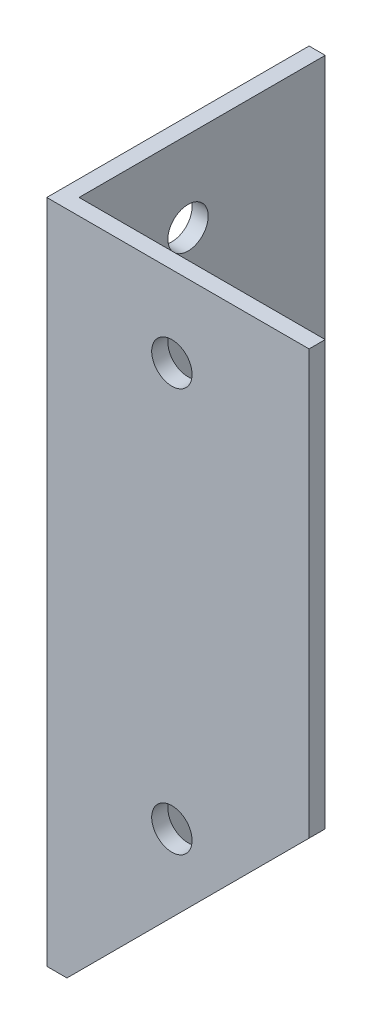
ISO-10303-21;
HEADER;
FILE_DESCRIPTION(('STEP AP214'),'2;1');
FILE_NAME('part.step','',(''),(''),'','','');
FILE_SCHEMA(('AUTOMOTIVE_DESIGN { 1 0 10303 214 1 1 1 1 }'));
ENDSEC;
DATA;
#1=APPLICATION_CONTEXT('core data for automotive mechanical design processes');
#2=APPLICATION_PROTOCOL_DEFINITION('international standard','automotive_design',2000,#1);
#3=PRODUCT_CONTEXT('',#1,'mechanical');
#4=PRODUCT('Part','Part','',(#3));
#5=PRODUCT_RELATED_PRODUCT_CATEGORY('part','',(#4));
#6=PRODUCT_DEFINITION_FORMATION('','',#4);
#7=PRODUCT_DEFINITION_CONTEXT('part definition',#1,'design');
#8=PRODUCT_DEFINITION('design','',#6,#7);
#9=PRODUCT_DEFINITION_SHAPE('','',#8);
#10=(LENGTH_UNIT() NAMED_UNIT(*) SI_UNIT(.MILLI.,.METRE.));
#11=(NAMED_UNIT(*) PLANE_ANGLE_UNIT() SI_UNIT($,.RADIAN.));
#12=(NAMED_UNIT(*) SI_UNIT($,.STERADIAN.) SOLID_ANGLE_UNIT());
#13=UNCERTAINTY_MEASURE_WITH_UNIT(LENGTH_MEASURE(1.E-05),#10,'distance_accuracy_value','');
#14=(GEOMETRIC_REPRESENTATION_CONTEXT(3) GLOBAL_UNCERTAINTY_ASSIGNED_CONTEXT((#13)) GLOBAL_UNIT_ASSIGNED_CONTEXT((#10,
#11,#12)) REPRESENTATION_CONTEXT('',''));
#15=CARTESIAN_POINT('',(0.,0.,0.));
#16=DIRECTION('',(0.,0.,1.));
#17=DIRECTION('',(1.,0.,0.));
#18=AXIS2_PLACEMENT_3D('',#15,#16,#17);
#19=CARTESIAN_POINT('',(4.,165.,0.));
#20=DIRECTION('',(-1.,0.,0.));
#21=DIRECTION('',(0.,0.,1.));
#22=AXIS2_PLACEMENT_3D('',#19,#20,#21);
#23=PLANE('',#22);
#24=CARTESIAN_POINT('',(4.,45.,-30.9999999999947));
#25=DIRECTION('',(-1.,0.,0.));
#26=DIRECTION('',(0.,0.,1.));
#27=AXIS2_PLACEMENT_3D('',#24,#25,#26);
#28=CIRCLE('',#27,4.99999999999998);
#29=CARTESIAN_POINT('',(4.,45.,-25.9999999999947));
#30=VERTEX_POINT('',#29);
#31=EDGE_CURVE('E248',#30,#30,#28,.T.);
#32=ORIENTED_EDGE('',*,*,#31,.T.);
#33=EDGE_LOOP('',(#32));
#34=FACE_BOUND('',#33,.T.);
#35=CARTESIAN_POINT('',(4.,10.,-15.));
#36=DIRECTION('',(-1.,0.,0.));
#37=DIRECTION('',(0.,0.,1.));
#38=AXIS2_PLACEMENT_3D('',#35,#36,#37);
#39=CIRCLE('',#38,5.);
#40=CARTESIAN_POINT('',(4.,10.,-10.));
#41=VERTEX_POINT('',#40);
#42=EDGE_CURVE('E245',#41,#41,#39,.T.);
#43=ORIENTED_EDGE('',*,*,#42,.T.);
#44=EDGE_LOOP('',(#43));
#45=FACE_BOUND('',#44,.T.);
#46=CARTESIAN_POINT('',(4.,9.99999999999937,-45.));
#47=DIRECTION('',(-1.,0.,0.));
#48=DIRECTION('',(0.,0.,1.));
#49=AXIS2_PLACEMENT_3D('',#46,#47,#48);
#50=CIRCLE('',#49,5.);
#51=CARTESIAN_POINT('',(4.,9.99999999999937,-40.));
#52=VERTEX_POINT('',#51);
#53=EDGE_CURVE('E237',#52,#52,#50,.T.);
#54=ORIENTED_EDGE('',*,*,#53,.T.);
#55=EDGE_LOOP('',(#54));
#56=FACE_BOUND('',#55,.T.);
#57=CARTESIAN_POINT('',(4.,145.,-31.));
#58=DIRECTION('',(-1.,0.,0.));
#59=DIRECTION('',(0.,0.,1.));
#60=AXIS2_PLACEMENT_3D('',#57,#58,#59);
#61=CIRCLE('',#60,5.);
#62=CARTESIAN_POINT('',(4.,145.,-26.));
#63=VERTEX_POINT('',#62);
#64=EDGE_CURVE('E144',#63,#63,#61,.T.);
#65=ORIENTED_EDGE('',*,*,#64,.T.);
#66=EDGE_LOOP('',(#65));
#67=FACE_BOUND('',#66,.T.);
#68=DIRECTION('',(0.,0.,-1.));
#69=VECTOR('',#68,1.);
#70=CARTESIAN_POINT('',(4.,0.,0.));
#71=LINE('',#70,#69);
#72=CARTESIAN_POINT('',(4.,0.,-4.));
#73=VERTEX_POINT('',#72);
#74=CARTESIAN_POINT('',(4.,0.,-65.));
#75=VERTEX_POINT('',#74);
#76=EDGE_CURVE('E134',#73,#75,#71,.T.);
#77=ORIENTED_EDGE('',*,*,#76,.T.);
#78=DIRECTION('',(0.,-1.,0.));
#79=VECTOR('',#78,1.);
#80=CARTESIAN_POINT('',(4.,165.,-65.));
#81=LINE('',#80,#79);
#82=CARTESIAN_POINT('',(4.,165.,-65.));
#83=VERTEX_POINT('',#82);
#84=EDGE_CURVE('E44',#83,#75,#81,.T.);
#85=ORIENTED_EDGE('',*,*,#84,.F.);
#86=DIRECTION('',(0.,0.,-1.));
#87=VECTOR('',#86,1.);
#88=CARTESIAN_POINT('',(4.,165.,0.));
#89=LINE('',#88,#87);
#90=CARTESIAN_POINT('',(4.,165.,-4.));
#91=VERTEX_POINT('',#90);
#92=EDGE_CURVE('E153',#91,#83,#89,.T.);
#93=ORIENTED_EDGE('',*,*,#92,.F.);
#94=DIRECTION('',(0.,-1.,0.));
#95=VECTOR('',#94,1.);
#96=CARTESIAN_POINT('',(4.,165.,-4.));
#97=LINE('',#96,#95);
#98=EDGE_CURVE('E125',#91,#73,#97,.T.);
#99=ORIENTED_EDGE('',*,*,#98,.T.);
#100=EDGE_LOOP('',(#77,#85,#93,#99));
#101=FACE_BOUND('',#100,.T.);
#102=ADVANCED_FACE('F37',(#34,#45,#56,#67,#101),#23,.F.);
#103=CARTESIAN_POINT('',(0.,165.,-65.));
#104=DIRECTION('',(0.,0.,-1.));
#105=DIRECTION('',(-1.,0.,0.));
#106=AXIS2_PLACEMENT_3D('',#103,#104,#105);
#107=PLANE('',#106);
#108=DIRECTION('',(1.,0.,0.));
#109=VECTOR('',#108,1.);
#110=CARTESIAN_POINT('',(0.,0.,-65.));
#111=LINE('',#110,#109);
#112=CARTESIAN_POINT('',(0.,0.,-65.));
#113=VERTEX_POINT('',#112);
#114=EDGE_CURVE('E160',#113,#75,#111,.T.);
#115=ORIENTED_EDGE('',*,*,#114,.F.);
#116=DIRECTION('',(0.,-1.,0.));
#117=VECTOR('',#116,1.);
#118=CARTESIAN_POINT('',(0.,165.,-65.));
#119=LINE('',#118,#117);
#120=CARTESIAN_POINT('',(0.,165.,-65.));
#121=VERTEX_POINT('',#120);
#122=EDGE_CURVE('E123',#121,#113,#119,.T.);
#123=ORIENTED_EDGE('',*,*,#122,.F.);
#124=DIRECTION('',(1.,0.,0.));
#125=VECTOR('',#124,1.);
#126=CARTESIAN_POINT('',(0.,165.,-65.));
#127=LINE('',#126,#125);
#128=EDGE_CURVE('E86',#121,#83,#127,.T.);
#129=ORIENTED_EDGE('',*,*,#128,.T.);
#130=ORIENTED_EDGE('',*,*,#84,.T.);
#131=EDGE_LOOP('',(#115,#123,#129,#130));
#132=FACE_BOUND('',#131,.T.);
#133=ADVANCED_FACE('F173',(#132),#107,.T.);
#134=CARTESIAN_POINT('',(0.,165.,0.));
#135=DIRECTION('',(-1.,0.,0.));
#136=DIRECTION('',(0.,0.,1.));
#137=AXIS2_PLACEMENT_3D('',#134,#135,#136);
#138=PLANE('',#137);
#139=CARTESIAN_POINT('',(0.,45.,-30.9999999999947));
#140=DIRECTION('',(-1.,0.,0.));
#141=DIRECTION('',(0.,0.,1.));
#142=AXIS2_PLACEMENT_3D('',#139,#140,#141);
#143=CIRCLE('',#142,4.99999999999998);
#144=CARTESIAN_POINT('',(0.,45.,-25.9999999999947));
#145=VERTEX_POINT('',#144);
#146=EDGE_CURVE('E234',#145,#145,#143,.T.);
#147=ORIENTED_EDGE('',*,*,#146,.F.);
#148=EDGE_LOOP('',(#147));
#149=FACE_BOUND('',#148,.T.);
#150=CARTESIAN_POINT('',(0.,10.,-15.));
#151=DIRECTION('',(-1.,0.,0.));
#152=DIRECTION('',(0.,0.,1.));
#153=AXIS2_PLACEMENT_3D('',#150,#151,#152);
#154=CIRCLE('',#153,5.);
#155=CARTESIAN_POINT('',(0.,10.,-10.));
#156=VERTEX_POINT('',#155);
#157=EDGE_CURVE('E238',#156,#156,#154,.T.);
#158=ORIENTED_EDGE('',*,*,#157,.F.);
#159=EDGE_LOOP('',(#158));
#160=FACE_BOUND('',#159,.T.);
#161=CARTESIAN_POINT('',(0.,9.99999999999937,-45.));
#162=DIRECTION('',(-1.,0.,0.));
#163=DIRECTION('',(0.,0.,1.));
#164=AXIS2_PLACEMENT_3D('',#161,#162,#163);
#165=CIRCLE('',#164,5.);
#166=CARTESIAN_POINT('',(0.,9.99999999999937,-40.));
#167=VERTEX_POINT('',#166);
#168=EDGE_CURVE('E230',#167,#167,#165,.T.);
#169=ORIENTED_EDGE('',*,*,#168,.F.);
#170=EDGE_LOOP('',(#169));
#171=FACE_BOUND('',#170,.T.);
#172=CARTESIAN_POINT('',(0.,145.,-31.));
#173=DIRECTION('',(-1.,0.,0.));
#174=DIRECTION('',(0.,0.,1.));
#175=AXIS2_PLACEMENT_3D('',#172,#173,#174);
#176=CIRCLE('',#175,5.);
#177=CARTESIAN_POINT('',(0.,145.,-26.));
#178=VERTEX_POINT('',#177);
#179=EDGE_CURVE('E149',#178,#178,#176,.T.);
#180=ORIENTED_EDGE('',*,*,#179,.F.);
#181=EDGE_LOOP('',(#180));
#182=FACE_BOUND('',#181,.T.);
#183=DIRECTION('',(0.,0.,-1.));
#184=VECTOR('',#183,1.);
#185=CARTESIAN_POINT('',(0.,0.,0.));
#186=LINE('',#185,#184);
#187=CARTESIAN_POINT('',(0.,0.,0.));
#188=VERTEX_POINT('',#187);
#189=EDGE_CURVE('E162',#188,#113,#186,.T.);
#190=ORIENTED_EDGE('',*,*,#189,.F.);
#191=DIRECTION('',(0.,-1.,0.));
#192=VECTOR('',#191,1.);
#193=CARTESIAN_POINT('',(0.,165.,0.));
#194=LINE('',#193,#192);
#195=CARTESIAN_POINT('',(0.,165.,0.));
#196=VERTEX_POINT('',#195);
#197=EDGE_CURVE('E121',#196,#188,#194,.T.);
#198=ORIENTED_EDGE('',*,*,#197,.F.);
#199=DIRECTION('',(0.,0.,-1.));
#200=VECTOR('',#199,1.);
#201=CARTESIAN_POINT('',(0.,165.,0.));
#202=LINE('',#201,#200);
#203=EDGE_CURVE('E112',#196,#121,#202,.T.);
#204=ORIENTED_EDGE('',*,*,#203,.T.);
#205=ORIENTED_EDGE('',*,*,#122,.T.);
#206=EDGE_LOOP('',(#190,#198,#204,#205));
#207=FACE_BOUND('',#206,.T.);
#208=ADVANCED_FACE('F175',(#149,#160,#171,#182,#207),#138,.T.);
#209=CARTESIAN_POINT('',(0.,165.,0.));
#210=DIRECTION('',(0.,0.,1.));
#211=DIRECTION('',(1.,0.,0.));
#212=AXIS2_PLACEMENT_3D('',#209,#210,#211);
#213=PLANE('',#212);
#214=DIRECTION('',(-0.707106781186547,-0.707106781186547,0.));
#215=VECTOR('',#214,1.);
#216=CARTESIAN_POINT('',(5.,0.,0.));
#217=LINE('',#216,#215);
#218=CARTESIAN_POINT('',(65.,60.,0.));
#219=VERTEX_POINT('',#218);
#220=CARTESIAN_POINT('',(5.,0.,0.));
#221=VERTEX_POINT('',#220);
#222=EDGE_CURVE('E120',#219,#221,#217,.T.);
#223=ORIENTED_EDGE('',*,*,#222,.F.);
#224=DIRECTION('',(0.,-1.,0.));
#225=VECTOR('',#224,1.);
#226=CARTESIAN_POINT('',(65.,165.,0.));
#227=LINE('',#226,#225);
#228=CARTESIAN_POINT('',(65.,165.,0.));
#229=VERTEX_POINT('',#228);
#230=EDGE_CURVE('E104',#229,#219,#227,.T.);
#231=ORIENTED_EDGE('',*,*,#230,.F.);
#232=DIRECTION('',(-1.,0.,0.));
#233=VECTOR('',#232,1.);
#234=CARTESIAN_POINT('',(0.,165.,0.));
#235=LINE('',#234,#233);
#236=EDGE_CURVE('E108',#229,#196,#235,.T.);
#237=ORIENTED_EDGE('',*,*,#236,.T.);
#238=ORIENTED_EDGE('',*,*,#197,.T.);
#239=DIRECTION('',(-1.,0.,0.));
#240=VECTOR('',#239,1.);
#241=CARTESIAN_POINT('',(0.,0.,0.));
#242=LINE('',#241,#240);
#243=EDGE_CURVE('E164',#221,#188,#242,.T.);
#244=ORIENTED_EDGE('',*,*,#243,.F.);
#245=EDGE_LOOP('',(#223,#231,#237,#238,#244));
#246=FACE_BOUND('',#245,.T.);
#247=CARTESIAN_POINT('',(31.0000000000053,45.,0.));
#248=DIRECTION('',(0.,0.,1.));
#249=DIRECTION('',(1.,0.,0.));
#250=AXIS2_PLACEMENT_3D('',#247,#248,#249);
#251=CIRCLE('',#250,5.00000000000001);
#252=CARTESIAN_POINT('',(36.0000000000053,45.,0.));
#253=VERTEX_POINT('',#252);
#254=EDGE_CURVE('E138',#253,#253,#251,.T.);
#255=ORIENTED_EDGE('',*,*,#254,.F.);
#256=EDGE_LOOP('',(#255));
#257=FACE_BOUND('',#256,.T.);
#258=CARTESIAN_POINT('',(31.,145.,0.));
#259=DIRECTION('',(0.,0.,1.));
#260=DIRECTION('',(1.,0.,0.));
#261=AXIS2_PLACEMENT_3D('',#258,#259,#260);
#262=CIRCLE('',#261,5.);
#263=CARTESIAN_POINT('',(36.,145.,0.));
#264=VERTEX_POINT('',#263);
#265=EDGE_CURVE('E135',#264,#264,#262,.T.);
#266=ORIENTED_EDGE('',*,*,#265,.F.);
#267=EDGE_LOOP('',(#266));
#268=FACE_BOUND('',#267,.T.);
#269=ADVANCED_FACE('F117',(#246,#257,#268),#213,.T.);
#270=CARTESIAN_POINT('',(65.,165.,-4.));
#271=DIRECTION('',(1.,0.,0.));
#272=DIRECTION('',(0.,0.,-1.));
#273=AXIS2_PLACEMENT_3D('',#270,#271,#272);
#274=PLANE('',#273);
#275=DIRECTION('',(0.,0.,1.));
#276=VECTOR('',#275,1.);
#277=CARTESIAN_POINT('',(65.,60.,-65.));
#278=LINE('',#277,#276);
#279=CARTESIAN_POINT('',(65.,60.,-4.));
#280=VERTEX_POINT('',#279);
#281=EDGE_CURVE('E225',#280,#219,#278,.T.);
#282=ORIENTED_EDGE('',*,*,#281,.F.);
#283=DIRECTION('',(0.,-1.,0.));
#284=VECTOR('',#283,1.);
#285=CARTESIAN_POINT('',(65.,165.,-4.));
#286=LINE('',#285,#284);
#287=CARTESIAN_POINT('',(65.,165.,-4.));
#288=VERTEX_POINT('',#287);
#289=EDGE_CURVE('E107',#288,#280,#286,.T.);
#290=ORIENTED_EDGE('',*,*,#289,.F.);
#291=DIRECTION('',(0.,0.,1.));
#292=VECTOR('',#291,1.);
#293=CARTESIAN_POINT('',(65.,165.,-4.));
#294=LINE('',#293,#292);
#295=EDGE_CURVE('E98',#288,#229,#294,.T.);
#296=ORIENTED_EDGE('',*,*,#295,.T.);
#297=ORIENTED_EDGE('',*,*,#230,.T.);
#298=EDGE_LOOP('',(#282,#290,#296,#297));
#299=FACE_BOUND('',#298,.T.);
#300=ADVANCED_FACE('F101',(#299),#274,.T.);
#301=CARTESIAN_POINT('',(0.,165.,-4.));
#302=DIRECTION('',(0.,0.,1.));
#303=DIRECTION('',(1.,0.,0.));
#304=AXIS2_PLACEMENT_3D('',#301,#302,#303);
#305=PLANE('',#304);
#306=CARTESIAN_POINT('',(31.0000000000053,45.,-4.));
#307=DIRECTION('',(0.,0.,1.));
#308=DIRECTION('',(1.,0.,0.));
#309=AXIS2_PLACEMENT_3D('',#306,#307,#308);
#310=CIRCLE('',#309,5.00000000000001);
#311=CARTESIAN_POINT('',(36.0000000000053,45.,-4.));
#312=VERTEX_POINT('',#311);
#313=EDGE_CURVE('E136',#312,#312,#310,.T.);
#314=ORIENTED_EDGE('',*,*,#313,.T.);
#315=EDGE_LOOP('',(#314));
#316=FACE_BOUND('',#315,.T.);
#317=CARTESIAN_POINT('',(31.,145.,-4.));
#318=DIRECTION('',(0.,0.,1.));
#319=DIRECTION('',(1.,0.,0.));
#320=AXIS2_PLACEMENT_3D('',#317,#318,#319);
#321=CIRCLE('',#320,5.);
#322=CARTESIAN_POINT('',(36.,145.,-4.));
#323=VERTEX_POINT('',#322);
#324=EDGE_CURVE('E132',#323,#323,#321,.T.);
#325=ORIENTED_EDGE('',*,*,#324,.T.);
#326=EDGE_LOOP('',(#325));
#327=FACE_BOUND('',#326,.T.);
#328=ORIENTED_EDGE('',*,*,#289,.T.);
#329=DIRECTION('',(-0.707106781186548,-0.707106781186548,0.));
#330=VECTOR('',#329,1.);
#331=CARTESIAN_POINT('',(85.,80.,-4.));
#332=LINE('',#331,#330);
#333=CARTESIAN_POINT('',(5.,0.,-4.));
#334=VERTEX_POINT('',#333);
#335=EDGE_CURVE('E227',#280,#334,#332,.T.);
#336=ORIENTED_EDGE('',*,*,#335,.T.);
#337=DIRECTION('',(1.,0.,0.));
#338=VECTOR('',#337,1.);
#339=CARTESIAN_POINT('',(0.,0.,-4.));
#340=LINE('',#339,#338);
#341=EDGE_CURVE('E77',#334,#73,#340,.F.);
#342=ORIENTED_EDGE('',*,*,#341,.T.);
#343=ORIENTED_EDGE('',*,*,#98,.F.);
#344=DIRECTION('',(1.,0.,0.));
#345=VECTOR('',#344,1.);
#346=CARTESIAN_POINT('',(0.,165.,-4.));
#347=LINE('',#346,#345);
#348=EDGE_CURVE('E58',#288,#91,#347,.F.);
#349=ORIENTED_EDGE('',*,*,#348,.F.);
#350=EDGE_LOOP('',(#328,#336,#342,#343,#349));
#351=FACE_BOUND('',#350,.T.);
#352=ADVANCED_FACE('F188',(#316,#327,#351),#305,.F.);
#353=CARTESIAN_POINT('',(0.,165.,0.));
#354=DIRECTION('',(0.,-1.,0.));
#355=DIRECTION('',(-1.,0.,0.));
#356=AXIS2_PLACEMENT_3D('',#353,#354,#355);
#357=PLANE('',#356);
#358=ORIENTED_EDGE('',*,*,#92,.T.);
#359=ORIENTED_EDGE('',*,*,#128,.F.);
#360=ORIENTED_EDGE('',*,*,#203,.F.);
#361=ORIENTED_EDGE('',*,*,#236,.F.);
#362=ORIENTED_EDGE('',*,*,#295,.F.);
#363=ORIENTED_EDGE('',*,*,#348,.T.);
#364=EDGE_LOOP('',(#358,#359,#360,#361,#362,#363));
#365=FACE_BOUND('',#364,.T.);
#366=ADVANCED_FACE('F111',(#365),#357,.F.);
#367=CARTESIAN_POINT('',(0.,0.,0.));
#368=DIRECTION('',(0.,-1.,0.));
#369=DIRECTION('',(-1.,0.,0.));
#370=AXIS2_PLACEMENT_3D('',#367,#368,#369);
#371=PLANE('',#370);
#372=DIRECTION('',(0.,0.,-1.));
#373=VECTOR('',#372,1.);
#374=CARTESIAN_POINT('',(5.,0.,0.));
#375=LINE('',#374,#373);
#376=EDGE_CURVE('E11',#221,#334,#375,.T.);
#377=ORIENTED_EDGE('',*,*,#376,.F.);
#378=ORIENTED_EDGE('',*,*,#243,.T.);
#379=ORIENTED_EDGE('',*,*,#189,.T.);
#380=ORIENTED_EDGE('',*,*,#114,.T.);
#381=ORIENTED_EDGE('',*,*,#76,.F.);
#382=ORIENTED_EDGE('',*,*,#341,.F.);
#383=EDGE_LOOP('',(#377,#378,#379,#380,#381,#382));
#384=FACE_BOUND('',#383,.T.);
#385=ADVANCED_FACE('F170',(#384),#371,.T.);
#386=CARTESIAN_POINT('',(31.,145.,-10.));
#387=DIRECTION('',(0.,0.,1.));
#388=DIRECTION('',(1.,0.,0.));
#389=AXIS2_PLACEMENT_3D('',#386,#387,#388);
#390=CYLINDRICAL_SURFACE('',#389,5.);
#391=ORIENTED_EDGE('',*,*,#265,.T.);
#392=EDGE_LOOP('',(#391));
#393=FACE_BOUND('',#392,.T.);
#394=ORIENTED_EDGE('',*,*,#324,.F.);
#395=EDGE_LOOP('',(#394));
#396=FACE_BOUND('',#395,.T.);
#397=ADVANCED_FACE('F193',(#393,#396),#390,.F.);
#398=CARTESIAN_POINT('',(31.0000000000053,45.,-10.));
#399=DIRECTION('',(0.,0.,1.));
#400=DIRECTION('',(1.,0.,0.));
#401=AXIS2_PLACEMENT_3D('',#398,#399,#400);
#402=CYLINDRICAL_SURFACE('',#401,5.00000000000001);
#403=ORIENTED_EDGE('',*,*,#254,.T.);
#404=EDGE_LOOP('',(#403));
#405=FACE_BOUND('',#404,.T.);
#406=ORIENTED_EDGE('',*,*,#313,.F.);
#407=EDGE_LOOP('',(#406));
#408=FACE_BOUND('',#407,.T.);
#409=ADVANCED_FACE('F198',(#405,#408),#402,.F.);
#410=CARTESIAN_POINT('',(10.,145.,-31.));
#411=DIRECTION('',(-1.,0.,0.));
#412=DIRECTION('',(0.,0.,1.));
#413=AXIS2_PLACEMENT_3D('',#410,#411,#412);
#414=CYLINDRICAL_SURFACE('',#413,5.);
#415=ORIENTED_EDGE('',*,*,#179,.T.);
#416=EDGE_LOOP('',(#415));
#417=FACE_BOUND('',#416,.T.);
#418=ORIENTED_EDGE('',*,*,#64,.F.);
#419=EDGE_LOOP('',(#418));
#420=FACE_BOUND('',#419,.T.);
#421=ADVANCED_FACE('F202',(#417,#420),#414,.F.);
#422=CARTESIAN_POINT('',(10.,9.99999999999937,-45.));
#423=DIRECTION('',(-1.,0.,0.));
#424=DIRECTION('',(0.,0.,1.));
#425=AXIS2_PLACEMENT_3D('',#422,#423,#424);
#426=CYLINDRICAL_SURFACE('',#425,5.);
#427=ORIENTED_EDGE('',*,*,#168,.T.);
#428=EDGE_LOOP('',(#427));
#429=FACE_BOUND('',#428,.T.);
#430=ORIENTED_EDGE('',*,*,#53,.F.);
#431=EDGE_LOOP('',(#430));
#432=FACE_BOUND('',#431,.T.);
#433=ADVANCED_FACE('F205',(#429,#432),#426,.F.);
#434=CARTESIAN_POINT('',(10.,10.,-15.));
#435=DIRECTION('',(-1.,0.,0.));
#436=DIRECTION('',(0.,0.,1.));
#437=AXIS2_PLACEMENT_3D('',#434,#435,#436);
#438=CYLINDRICAL_SURFACE('',#437,5.);
#439=ORIENTED_EDGE('',*,*,#157,.T.);
#440=EDGE_LOOP('',(#439));
#441=FACE_BOUND('',#440,.T.);
#442=ORIENTED_EDGE('',*,*,#42,.F.);
#443=EDGE_LOOP('',(#442));
#444=FACE_BOUND('',#443,.T.);
#445=ADVANCED_FACE('F209',(#441,#444),#438,.F.);
#446=CARTESIAN_POINT('',(10.,45.,-30.9999999999947));
#447=DIRECTION('',(-1.,0.,0.));
#448=DIRECTION('',(0.,0.,1.));
#449=AXIS2_PLACEMENT_3D('',#446,#447,#448);
#450=CYLINDRICAL_SURFACE('',#449,4.99999999999998);
#451=ORIENTED_EDGE('',*,*,#146,.T.);
#452=EDGE_LOOP('',(#451));
#453=FACE_BOUND('',#452,.T.);
#454=ORIENTED_EDGE('',*,*,#31,.F.);
#455=EDGE_LOOP('',(#454));
#456=FACE_BOUND('',#455,.T.);
#457=ADVANCED_FACE('F213',(#453,#456),#450,.F.);
#458=CARTESIAN_POINT('',(5.,0.,-65.));
#459=DIRECTION('',(-0.707106781186547,0.707106781186547,0.));
#460=DIRECTION('',(-0.707106781186548,-0.707106781186548,0.));
#461=AXIS2_PLACEMENT_3D('',#458,#459,#460);
#462=PLANE('',#461);
#463=ORIENTED_EDGE('',*,*,#281,.T.);
#464=ORIENTED_EDGE('',*,*,#222,.T.);
#465=ORIENTED_EDGE('',*,*,#376,.T.);
#466=ORIENTED_EDGE('',*,*,#335,.F.);
#467=EDGE_LOOP('',(#463,#464,#465,#466));
#468=FACE_BOUND('',#467,.T.);
#469=ADVANCED_FACE('F217',(#468),#462,.F.);
#470=CLOSED_SHELL('',(#102,#133,#208,#269,#300,#352,#366,#385,#397,#409,#421,#433,#445,#457,#469));
#471=MANIFOLD_SOLID_BREP('B2',#470);
#472=ADVANCED_BREP_SHAPE_REPRESENTATION('',(#18,#471),#14);
#473=SHAPE_DEFINITION_REPRESENTATION(#9,#472);
ENDSEC;
END-ISO-10303-21;
